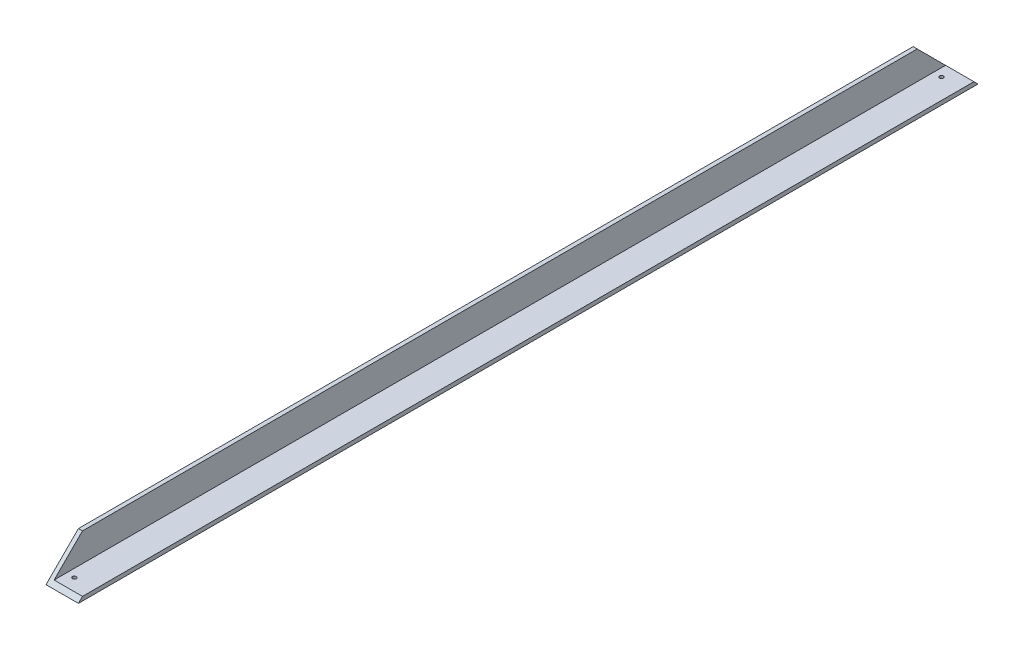
ISO-10303-21;
HEADER;
FILE_DESCRIPTION(('STEP AP214'),'2;1');
FILE_NAME('part.step','',(''),(''),'','','');
FILE_SCHEMA(('AUTOMOTIVE_DESIGN { 1 0 10303 214 1 1 1 1 }'));
ENDSEC;
DATA;
#1=APPLICATION_CONTEXT('core data for automotive mechanical design processes');
#2=APPLICATION_PROTOCOL_DEFINITION('international standard','automotive_design',2000,#1);
#3=PRODUCT_CONTEXT('',#1,'mechanical');
#4=PRODUCT('Part','Part','',(#3));
#5=PRODUCT_RELATED_PRODUCT_CATEGORY('part','',(#4));
#6=PRODUCT_DEFINITION_FORMATION('','',#4);
#7=PRODUCT_DEFINITION_CONTEXT('part definition',#1,'design');
#8=PRODUCT_DEFINITION('design','',#6,#7);
#9=PRODUCT_DEFINITION_SHAPE('','',#8);
#10=(LENGTH_UNIT() NAMED_UNIT(*) SI_UNIT(.MILLI.,.METRE.));
#11=(NAMED_UNIT(*) PLANE_ANGLE_UNIT() SI_UNIT($,.RADIAN.));
#12=(NAMED_UNIT(*) SI_UNIT($,.STERADIAN.) SOLID_ANGLE_UNIT());
#13=UNCERTAINTY_MEASURE_WITH_UNIT(LENGTH_MEASURE(1.E-05),#10,'distance_accuracy_value','');
#14=(GEOMETRIC_REPRESENTATION_CONTEXT(3) GLOBAL_UNCERTAINTY_ASSIGNED_CONTEXT((#13)) GLOBAL_UNIT_ASSIGNED_CONTEXT((#10,
#11,#12)) REPRESENTATION_CONTEXT('',''));
#15=CARTESIAN_POINT('',(0.,0.,0.));
#16=DIRECTION('',(0.,0.,1.));
#17=DIRECTION('',(1.,0.,0.));
#18=AXIS2_PLACEMENT_3D('',#15,#16,#17);
#19=CARTESIAN_POINT('',(25.4,0.,704.85));
#20=DIRECTION('',(-1.,0.,0.));
#21=DIRECTION('',(0.,0.,1.));
#22=AXIS2_PLACEMENT_3D('',#19,#20,#21);
#23=PLANE('',#22);
#24=DIRECTION('',(0.,0.707106781186543,-0.707106781186552));
#25=VECTOR('',#24,1.);
#26=CARTESIAN_POINT('',(25.4,0.,704.85));
#27=LINE('',#26,#25);
#28=CARTESIAN_POINT('',(25.4,0.,704.85));
#29=VERTEX_POINT('',#28);
#30=CARTESIAN_POINT('',(25.4,3.17500000000001,701.675));
#31=VERTEX_POINT('',#30);
#32=EDGE_CURVE('E147',#29,#31,#27,.T.);
#33=ORIENTED_EDGE('',*,*,#32,.F.);
#34=DIRECTION('',(0.,0.,-1.));
#35=VECTOR('',#34,1.);
#36=CARTESIAN_POINT('',(25.4,0.,704.85));
#37=LINE('',#36,#35);
#38=CARTESIAN_POINT('',(25.4,0.,0.));
#39=VERTEX_POINT('',#38);
#40=EDGE_CURVE('E11',#29,#39,#37,.T.);
#41=ORIENTED_EDGE('',*,*,#40,.T.);
#42=DIRECTION('',(0.,0.707106781186547,0.707106781186548));
#43=VECTOR('',#42,1.);
#44=CARTESIAN_POINT('',(25.4,352.425,352.425));
#45=LINE('',#44,#43);
#46=CARTESIAN_POINT('',(25.4,3.17500000000001,3.17500000000004));
#47=VERTEX_POINT('',#46);
#48=EDGE_CURVE('E137',#39,#47,#45,.T.);
#49=ORIENTED_EDGE('',*,*,#48,.T.);
#50=DIRECTION('',(0.,0.,-1.));
#51=VECTOR('',#50,1.);
#52=CARTESIAN_POINT('',(25.4,3.17500000000001,704.85));
#53=LINE('',#52,#51);
#54=EDGE_CURVE('E54',#31,#47,#53,.T.);
#55=ORIENTED_EDGE('',*,*,#54,.F.);
#56=EDGE_LOOP('',(#33,#41,#49,#55));
#57=FACE_BOUND('',#56,.T.);
#58=ADVANCED_FACE('F45',(#57),#23,.F.);
#59=CARTESIAN_POINT('',(25.4,3.17500000000001,704.85));
#60=DIRECTION('',(0.,-1.,0.));
#61=DIRECTION('',(1.,0.,0.));
#62=AXIS2_PLACEMENT_3D('',#59,#60,#61);
#63=PLANE('',#62);
#64=CARTESIAN_POINT('',(9.525,3.17500000000004,12.7000000000002));
#65=DIRECTION('',(0.,-1.,0.));
#66=DIRECTION('',(1.,0.,0.));
#67=AXIS2_PLACEMENT_3D('',#64,#65,#66);
#68=CIRCLE('',#67,1.5);
#69=CARTESIAN_POINT('',(11.025,3.17500000000004,12.7000000000002));
#70=VERTEX_POINT('',#69);
#71=EDGE_CURVE('E163',#70,#70,#68,.T.);
#72=ORIENTED_EDGE('',*,*,#71,.T.);
#73=EDGE_LOOP('',(#72));
#74=FACE_BOUND('',#73,.T.);
#75=CARTESIAN_POINT('',(9.525,3.17500000000004,692.15));
#76=DIRECTION('',(0.,-1.,0.));
#77=DIRECTION('',(1.,0.,0.));
#78=AXIS2_PLACEMENT_3D('',#75,#76,#77);
#79=CIRCLE('',#78,1.5);
#80=CARTESIAN_POINT('',(11.025,3.17500000000004,692.15));
#81=VERTEX_POINT('',#80);
#82=EDGE_CURVE('E108',#81,#81,#79,.T.);
#83=ORIENTED_EDGE('',*,*,#82,.T.);
#84=EDGE_LOOP('',(#83));
#85=FACE_BOUND('',#84,.T.);
#86=DIRECTION('',(-1.,0.,0.));
#87=VECTOR('',#86,1.);
#88=CARTESIAN_POINT('',(25.4,3.17500000000001,701.675));
#89=LINE('',#88,#87);
#90=CARTESIAN_POINT('',(3.175,3.175,701.675));
#91=VERTEX_POINT('',#90);
#92=EDGE_CURVE('E130',#31,#91,#89,.T.);
#93=ORIENTED_EDGE('',*,*,#92,.F.);
#94=ORIENTED_EDGE('',*,*,#54,.T.);
#95=DIRECTION('',(-1.,0.,0.));
#96=VECTOR('',#95,1.);
#97=CARTESIAN_POINT('',(25.4000000000001,3.17500000000001,3.17500000000004));
#98=LINE('',#97,#96);
#99=CARTESIAN_POINT('',(3.175,3.17500000000004,3.17500000000004));
#100=VERTEX_POINT('',#99);
#101=EDGE_CURVE('E129',#47,#100,#98,.T.);
#102=ORIENTED_EDGE('',*,*,#101,.T.);
#103=DIRECTION('',(0.,0.,-1.));
#104=VECTOR('',#103,1.);
#105=CARTESIAN_POINT('',(3.175,3.175,704.85));
#106=LINE('',#105,#104);
#107=EDGE_CURVE('E116',#91,#100,#106,.T.);
#108=ORIENTED_EDGE('',*,*,#107,.F.);
#109=EDGE_LOOP('',(#93,#94,#102,#108));
#110=FACE_BOUND('',#109,.T.);
#111=ADVANCED_FACE('F127',(#74,#85,#110),#63,.F.);
#112=CARTESIAN_POINT('',(3.175,3.175,704.85));
#113=DIRECTION('',(-1.,0.,0.));
#114=DIRECTION('',(0.,-1.,0.));
#115=AXIS2_PLACEMENT_3D('',#112,#113,#114);
#116=PLANE('',#115);
#117=DIRECTION('',(0.,0.707106781186543,-0.707106781186552));
#118=VECTOR('',#117,1.);
#119=CARTESIAN_POINT('',(3.175,1.58750000000004,703.2625));
#120=LINE('',#119,#118);
#121=CARTESIAN_POINT('',(3.17500000000004,25.4,679.45));
#122=VERTEX_POINT('',#121);
#123=EDGE_CURVE('E95',#91,#122,#120,.T.);
#124=ORIENTED_EDGE('',*,*,#123,.F.);
#125=ORIENTED_EDGE('',*,*,#107,.T.);
#126=DIRECTION('',(0.,0.707106781186547,0.707106781186548));
#127=VECTOR('',#126,1.);
#128=CARTESIAN_POINT('',(3.17499999999997,354.0125,354.0125));
#129=LINE('',#128,#127);
#130=CARTESIAN_POINT('',(3.17500000000004,25.4,25.4));
#131=VERTEX_POINT('',#130);
#132=EDGE_CURVE('E139',#100,#131,#129,.T.);
#133=ORIENTED_EDGE('',*,*,#132,.T.);
#134=DIRECTION('',(0.,0.,-1.));
#135=VECTOR('',#134,1.);
#136=CARTESIAN_POINT('',(3.175,25.4,704.85));
#137=LINE('',#136,#135);
#138=EDGE_CURVE('E114',#122,#131,#137,.T.);
#139=ORIENTED_EDGE('',*,*,#138,.F.);
#140=EDGE_LOOP('',(#124,#125,#133,#139));
#141=FACE_BOUND('',#140,.T.);
#142=ADVANCED_FACE('F155',(#141),#116,.F.);
#143=CARTESIAN_POINT('',(3.175,25.4,704.85));
#144=DIRECTION('',(0.,-1.,0.));
#145=DIRECTION('',(0.,0.,-1.));
#146=AXIS2_PLACEMENT_3D('',#143,#144,#145);
#147=PLANE('',#146);
#148=DIRECTION('',(-1.,0.,0.));
#149=VECTOR('',#148,1.);
#150=CARTESIAN_POINT('',(711.2,25.4,679.45));
#151=LINE('',#150,#149);
#152=CARTESIAN_POINT('',(0.,25.4,679.45));
#153=VERTEX_POINT('',#152);
#154=EDGE_CURVE('E92',#122,#153,#151,.T.);
#155=ORIENTED_EDGE('',*,*,#154,.F.);
#156=ORIENTED_EDGE('',*,*,#138,.T.);
#157=DIRECTION('',(-1.,0.,0.));
#158=VECTOR('',#157,1.);
#159=CARTESIAN_POINT('',(711.2,25.4,25.4));
#160=LINE('',#159,#158);
#161=CARTESIAN_POINT('',(0.,25.4,25.4));
#162=VERTEX_POINT('',#161);
#163=EDGE_CURVE('E113',#131,#162,#160,.T.);
#164=ORIENTED_EDGE('',*,*,#163,.T.);
#165=DIRECTION('',(0.,0.,-1.));
#166=VECTOR('',#165,1.);
#167=CARTESIAN_POINT('',(0.,25.4,704.85));
#168=LINE('',#167,#166);
#169=EDGE_CURVE('E103',#153,#162,#168,.T.);
#170=ORIENTED_EDGE('',*,*,#169,.F.);
#171=EDGE_LOOP('',(#155,#156,#164,#170));
#172=FACE_BOUND('',#171,.T.);
#173=ADVANCED_FACE('F111',(#172),#147,.F.);
#174=CARTESIAN_POINT('',(0.,25.4,704.85));
#175=DIRECTION('',(1.,0.,0.));
#176=DIRECTION('',(0.,0.,-1.));
#177=AXIS2_PLACEMENT_3D('',#174,#175,#176);
#178=PLANE('',#177);
#179=DIRECTION('',(0.,0.707106781186543,-0.707106781186552));
#180=VECTOR('',#179,1.);
#181=CARTESIAN_POINT('',(0.,352.425,352.424999999996));
#182=LINE('',#181,#180);
#183=CARTESIAN_POINT('',(0.,0.,704.85));
#184=VERTEX_POINT('',#183);
#185=EDGE_CURVE('E60',#184,#153,#182,.T.);
#186=ORIENTED_EDGE('',*,*,#185,.T.);
#187=ORIENTED_EDGE('',*,*,#169,.T.);
#188=DIRECTION('',(0.,0.707106781186547,0.707106781186548));
#189=VECTOR('',#188,1.);
#190=CARTESIAN_POINT('',(0.,0.,0.));
#191=LINE('',#190,#189);
#192=CARTESIAN_POINT('',(0.,0.,2.22044604925031E-13));
#193=VERTEX_POINT('',#192);
#194=EDGE_CURVE('E149',#193,#162,#191,.T.);
#195=ORIENTED_EDGE('',*,*,#194,.F.);
#196=DIRECTION('',(0.,0.,-1.));
#197=VECTOR('',#196,1.);
#198=CARTESIAN_POINT('',(0.,0.,704.85));
#199=LINE('',#198,#197);
#200=EDGE_CURVE('E106',#184,#193,#199,.T.);
#201=ORIENTED_EDGE('',*,*,#200,.F.);
#202=EDGE_LOOP('',(#186,#187,#195,#201));
#203=FACE_BOUND('',#202,.T.);
#204=ADVANCED_FACE('F101',(#203),#178,.F.);
#205=CARTESIAN_POINT('',(0.,0.,704.85));
#206=DIRECTION('',(0.,1.,0.));
#207=DIRECTION('',(0.,0.,1.));
#208=AXIS2_PLACEMENT_3D('',#205,#206,#207);
#209=PLANE('',#208);
#210=CARTESIAN_POINT('',(9.525,0.,12.7000000000002));
#211=DIRECTION('',(0.,-1.,0.));
#212=DIRECTION('',(0.,0.,-1.));
#213=AXIS2_PLACEMENT_3D('',#210,#211,#212);
#214=CIRCLE('',#213,1.5);
#215=CARTESIAN_POINT('',(9.525,0.,11.2000000000002));
#216=VERTEX_POINT('',#215);
#217=EDGE_CURVE('E166',#216,#216,#214,.T.);
#218=ORIENTED_EDGE('',*,*,#217,.F.);
#219=EDGE_LOOP('',(#218));
#220=FACE_BOUND('',#219,.T.);
#221=CARTESIAN_POINT('',(9.525,0.,692.15));
#222=DIRECTION('',(0.,-1.,0.));
#223=DIRECTION('',(0.,0.,-1.));
#224=AXIS2_PLACEMENT_3D('',#221,#222,#223);
#225=CIRCLE('',#224,1.5);
#226=CARTESIAN_POINT('',(9.525,0.,690.65));
#227=VERTEX_POINT('',#226);
#228=EDGE_CURVE('E160',#227,#227,#225,.T.);
#229=ORIENTED_EDGE('',*,*,#228,.F.);
#230=EDGE_LOOP('',(#229));
#231=FACE_BOUND('',#230,.T.);
#232=DIRECTION('',(1.,0.,0.));
#233=VECTOR('',#232,1.);
#234=CARTESIAN_POINT('',(0.,0.,0.));
#235=LINE('',#234,#233);
#236=EDGE_CURVE('E143',#193,#39,#235,.T.);
#237=ORIENTED_EDGE('',*,*,#236,.T.);
#238=ORIENTED_EDGE('',*,*,#40,.F.);
#239=DIRECTION('',(1.,0.,0.));
#240=VECTOR('',#239,1.);
#241=CARTESIAN_POINT('',(0.,0.,704.85));
#242=LINE('',#241,#240);
#243=EDGE_CURVE('E118',#184,#29,#242,.T.);
#244=ORIENTED_EDGE('',*,*,#243,.F.);
#245=ORIENTED_EDGE('',*,*,#200,.T.);
#246=EDGE_LOOP('',(#237,#238,#244,#245));
#247=FACE_BOUND('',#246,.T.);
#248=ADVANCED_FACE('F47',(#220,#231,#247),#209,.F.);
#249=CARTESIAN_POINT('',(711.2,0.,0.));
#250=DIRECTION('',(0.,-0.707106781186548,0.707106781186547));
#251=DIRECTION('',(0.,-0.707106781186547,-0.707106781186548));
#252=AXIS2_PLACEMENT_3D('',#249,#250,#251);
#253=PLANE('',#252);
#254=ORIENTED_EDGE('',*,*,#236,.F.);
#255=ORIENTED_EDGE('',*,*,#194,.T.);
#256=ORIENTED_EDGE('',*,*,#163,.F.);
#257=ORIENTED_EDGE('',*,*,#132,.F.);
#258=ORIENTED_EDGE('',*,*,#101,.F.);
#259=ORIENTED_EDGE('',*,*,#48,.F.);
#260=EDGE_LOOP('',(#254,#255,#256,#257,#258,#259));
#261=FACE_BOUND('',#260,.T.);
#262=ADVANCED_FACE('F136',(#261),#253,.F.);
#263=CARTESIAN_POINT('',(711.2,352.425,352.424999999996));
#264=DIRECTION('',(0.,0.707106781186552,0.707106781186543));
#265=DIRECTION('',(0.,-0.707106781186543,0.707106781186552));
#266=AXIS2_PLACEMENT_3D('',#263,#264,#265);
#267=PLANE('',#266);
#268=ORIENTED_EDGE('',*,*,#32,.T.);
#269=ORIENTED_EDGE('',*,*,#92,.T.);
#270=ORIENTED_EDGE('',*,*,#123,.T.);
#271=ORIENTED_EDGE('',*,*,#154,.T.);
#272=ORIENTED_EDGE('',*,*,#185,.F.);
#273=ORIENTED_EDGE('',*,*,#243,.T.);
#274=EDGE_LOOP('',(#268,#269,#270,#271,#272,#273));
#275=FACE_BOUND('',#274,.T.);
#276=ADVANCED_FACE('F93',(#275),#267,.T.);
#277=CARTESIAN_POINT('',(9.525,711.2,692.15));
#278=DIRECTION('',(0.,-1.,0.));
#279=DIRECTION('',(0.,0.,-1.));
#280=AXIS2_PLACEMENT_3D('',#277,#278,#279);
#281=CYLINDRICAL_SURFACE('',#280,1.5);
#282=ORIENTED_EDGE('',*,*,#228,.T.);
#283=EDGE_LOOP('',(#282));
#284=FACE_BOUND('',#283,.T.);
#285=ORIENTED_EDGE('',*,*,#82,.F.);
#286=EDGE_LOOP('',(#285));
#287=FACE_BOUND('',#286,.T.);
#288=ADVANCED_FACE('F177',(#284,#287),#281,.F.);
#289=CARTESIAN_POINT('',(9.525,711.2,12.7000000000002));
#290=DIRECTION('',(0.,-1.,0.));
#291=DIRECTION('',(0.,0.,-1.));
#292=AXIS2_PLACEMENT_3D('',#289,#290,#291);
#293=CYLINDRICAL_SURFACE('',#292,1.5);
#294=ORIENTED_EDGE('',*,*,#217,.T.);
#295=EDGE_LOOP('',(#294));
#296=FACE_BOUND('',#295,.T.);
#297=ORIENTED_EDGE('',*,*,#71,.F.);
#298=EDGE_LOOP('',(#297));
#299=FACE_BOUND('',#298,.T.);
#300=ADVANCED_FACE('F170',(#296,#299),#293,.F.);
#301=CLOSED_SHELL('',(#58,#111,#142,#173,#204,#248,#262,#276,#288,#300));
#302=MANIFOLD_SOLID_BREP('B2',#301);
#303=ADVANCED_BREP_SHAPE_REPRESENTATION('',(#18,#302),#14);
#304=SHAPE_DEFINITION_REPRESENTATION(#9,#303);
ENDSEC;
END-ISO-10303-21;
